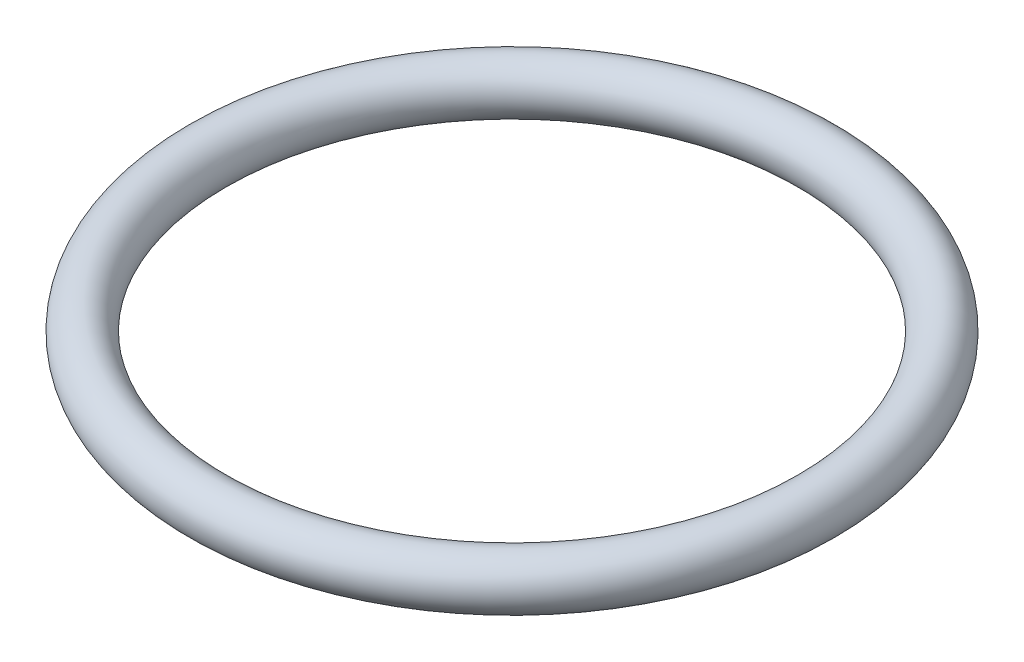
ISO-10303-21;
HEADER;
FILE_DESCRIPTION(('STEP AP214'),'2;1');
FILE_NAME('part.step','',(''),(''),'','','');
FILE_SCHEMA(('AUTOMOTIVE_DESIGN { 1 0 10303 214 1 1 1 1 }'));
ENDSEC;
DATA;
#1=APPLICATION_CONTEXT('core data for automotive mechanical design processes');
#2=APPLICATION_PROTOCOL_DEFINITION('international standard','automotive_design',2000,#1);
#3=PRODUCT_CONTEXT('',#1,'mechanical');
#4=PRODUCT('Part','Part','',(#3));
#5=PRODUCT_RELATED_PRODUCT_CATEGORY('part','',(#4));
#6=PRODUCT_DEFINITION_FORMATION('','',#4);
#7=PRODUCT_DEFINITION_CONTEXT('part definition',#1,'design');
#8=PRODUCT_DEFINITION('design','',#6,#7);
#9=PRODUCT_DEFINITION_SHAPE('','',#8);
#10=(LENGTH_UNIT() NAMED_UNIT(*) SI_UNIT(.MILLI.,.METRE.));
#11=(NAMED_UNIT(*) PLANE_ANGLE_UNIT() SI_UNIT($,.RADIAN.));
#12=(NAMED_UNIT(*) SI_UNIT($,.STERADIAN.) SOLID_ANGLE_UNIT());
#13=UNCERTAINTY_MEASURE_WITH_UNIT(LENGTH_MEASURE(1.E-05),#10,'distance_accuracy_value','');
#14=(GEOMETRIC_REPRESENTATION_CONTEXT(3) GLOBAL_UNCERTAINTY_ASSIGNED_CONTEXT((#13)) GLOBAL_UNIT_ASSIGNED_CONTEXT((#10,
#11,#12)) REPRESENTATION_CONTEXT('',''));
#15=CARTESIAN_POINT('',(0.,0.,0.));
#16=DIRECTION('',(0.,0.,1.));
#17=DIRECTION('',(1.,0.,0.));
#18=AXIS2_PLACEMENT_3D('',#15,#16,#17);
#19=CARTESIAN_POINT('',(0.,-2.75,0.));
#20=DIRECTION('',(0.,1.,0.));
#21=DIRECTION('',(-1.,0.,0.));
#22=AXIS2_PLACEMENT_3D('',#19,#20,#21);
#23=TOROIDAL_SURFACE('',#22,20.75,1.75);
#24=CARTESIAN_POINT('',(-22.5,-2.75,0.));
#25=VERTEX_POINT('',#24);
#26=VERTEX_LOOP('',#25);
#27=FACE_BOUND('',#26,.T.);
#28=ADVANCED_FACE('F42',(#27),#23,.T.);
#29=CLOSED_SHELL('',(#28));
#30=MANIFOLD_SOLID_BREP('B2',#29);
#31=ADVANCED_BREP_SHAPE_REPRESENTATION('',(#18,#30),#14);
#32=SHAPE_DEFINITION_REPRESENTATION(#9,#31);
ENDSEC;
END-ISO-10303-21;
